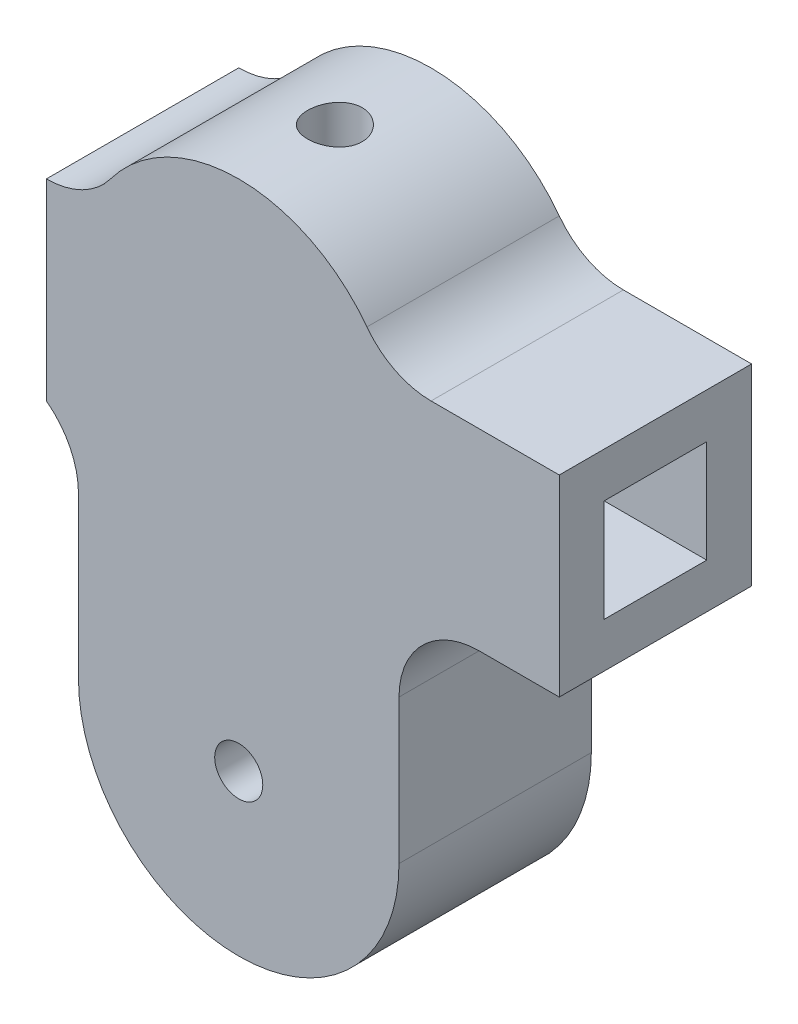
ISO-10303-21;
HEADER;
FILE_DESCRIPTION(('STEP AP214'),'2;1');
FILE_NAME('part.step','',(''),(''),'','','');
FILE_SCHEMA(('AUTOMOTIVE_DESIGN { 1 0 10303 214 1 1 1 1 }'));
ENDSEC;
DATA;
#1=APPLICATION_CONTEXT('core data for automotive mechanical design processes');
#2=APPLICATION_PROTOCOL_DEFINITION('international standard','automotive_design',2000,#1);
#3=PRODUCT_CONTEXT('',#1,'mechanical');
#4=PRODUCT('Part','Part','',(#3));
#5=PRODUCT_RELATED_PRODUCT_CATEGORY('part','',(#4));
#6=PRODUCT_DEFINITION_FORMATION('','',#4);
#7=PRODUCT_DEFINITION_CONTEXT('part definition',#1,'design');
#8=PRODUCT_DEFINITION('design','',#6,#7);
#9=PRODUCT_DEFINITION_SHAPE('','',#8);
#10=(LENGTH_UNIT() NAMED_UNIT(*) SI_UNIT(.MILLI.,.METRE.));
#11=(NAMED_UNIT(*) PLANE_ANGLE_UNIT() SI_UNIT($,.RADIAN.));
#12=(NAMED_UNIT(*) SI_UNIT($,.STERADIAN.) SOLID_ANGLE_UNIT());
#13=UNCERTAINTY_MEASURE_WITH_UNIT(LENGTH_MEASURE(1.E-05),#10,'distance_accuracy_value','');
#14=(GEOMETRIC_REPRESENTATION_CONTEXT(3) GLOBAL_UNCERTAINTY_ASSIGNED_CONTEXT((#13)) GLOBAL_UNIT_ASSIGNED_CONTEXT((#10,
#11,#12)) REPRESENTATION_CONTEXT('',''));
#15=CARTESIAN_POINT('',(0.,0.,0.));
#16=DIRECTION('',(0.,0.,1.));
#17=DIRECTION('',(1.,0.,0.));
#18=AXIS2_PLACEMENT_3D('',#15,#16,#17);
#19=CARTESIAN_POINT('',(0.,22.,0.));
#20=DIRECTION('',(0.,0.,1.));
#21=DIRECTION('',(1.,0.,0.));
#22=AXIS2_PLACEMENT_3D('',#19,#20,#21);
#23=PLANE('',#22);
#24=DIRECTION('',(1.,0.,0.));
#25=VECTOR('',#24,1.);
#26=CARTESIAN_POINT('',(2.8,27.8,0.));
#27=LINE('',#26,#25);
#28=CARTESIAN_POINT('',(-2.8,27.8,0.));
#29=VERTEX_POINT('',#28);
#30=CARTESIAN_POINT('',(2.8,27.8,0.));
#31=VERTEX_POINT('',#30);
#32=EDGE_CURVE('E233',#29,#31,#27,.T.);
#33=ORIENTED_EDGE('',*,*,#32,.F.);
#34=DIRECTION('',(0.,1.,0.));
#35=VECTOR('',#34,1.);
#36=CARTESIAN_POINT('',(-2.8,27.8,0.));
#37=LINE('',#36,#35);
#38=CARTESIAN_POINT('',(-2.8,24.7,0.));
#39=VERTEX_POINT('',#38);
#40=EDGE_CURVE('E200',#39,#29,#37,.T.);
#41=ORIENTED_EDGE('',*,*,#40,.F.);
#42=DIRECTION('',(-1.,0.,0.));
#43=VECTOR('',#42,1.);
#44=CARTESIAN_POINT('',(2.8,24.7,0.));
#45=LINE('',#44,#43);
#46=CARTESIAN_POINT('',(2.8,24.7,0.));
#47=VERTEX_POINT('',#46);
#48=EDGE_CURVE('E217',#47,#39,#45,.T.);
#49=ORIENTED_EDGE('',*,*,#48,.F.);
#50=DIRECTION('',(0.,-1.,0.));
#51=VECTOR('',#50,1.);
#52=CARTESIAN_POINT('',(2.8,27.8,0.));
#53=LINE('',#52,#51);
#54=EDGE_CURVE('E220',#31,#47,#53,.T.);
#55=ORIENTED_EDGE('',*,*,#54,.F.);
#56=EDGE_LOOP('',(#33,#41,#49,#55));
#57=FACE_BOUND('',#56,.T.);
#58=CARTESIAN_POINT('',(0.,22.,0.));
#59=DIRECTION('',(0.,0.,1.));
#60=DIRECTION('',(1.,0.,0.));
#61=AXIS2_PLACEMENT_3D('',#58,#59,#60);
#62=CIRCLE('',#61,10.);
#63=CARTESIAN_POINT('',(8.,28.,0.));
#64=VERTEX_POINT('',#63);
#65=CARTESIAN_POINT('',(-8.,28.,0.));
#66=VERTEX_POINT('',#65);
#67=EDGE_CURVE('E340',#64,#66,#62,.T.);
#68=ORIENTED_EDGE('',*,*,#67,.F.);
#69=CARTESIAN_POINT('',(12.,31.,0.));
#70=DIRECTION('',(0.,0.,1.));
#71=DIRECTION('',(1.,0.,0.));
#72=AXIS2_PLACEMENT_3D('',#69,#70,#71);
#73=CIRCLE('',#72,5.);
#74=CARTESIAN_POINT('',(12.,26.,0.));
#75=VERTEX_POINT('',#74);
#76=EDGE_CURVE('E392',#64,#75,#73,.T.);
#77=ORIENTED_EDGE('',*,*,#76,.T.);
#78=DIRECTION('',(1.,0.,0.));
#79=VECTOR('',#78,1.);
#80=CARTESIAN_POINT('',(-12.,26.,0.));
#81=LINE('',#80,#79);
#82=CARTESIAN_POINT('',(20.,26.,0.));
#83=VERTEX_POINT('',#82);
#84=EDGE_CURVE('E329',#75,#83,#81,.T.);
#85=ORIENTED_EDGE('',*,*,#84,.T.);
#86=DIRECTION('',(0.,1.,0.));
#87=VECTOR('',#86,1.);
#88=CARTESIAN_POINT('',(20.,14.,0.));
#89=LINE('',#88,#87);
#90=CARTESIAN_POINT('',(20.,14.,0.));
#91=VERTEX_POINT('',#90);
#92=EDGE_CURVE('E307',#91,#83,#89,.T.);
#93=ORIENTED_EDGE('',*,*,#92,.F.);
#94=DIRECTION('',(1.,0.,0.));
#95=VECTOR('',#94,1.);
#96=CARTESIAN_POINT('',(-12.,14.,0.));
#97=LINE('',#96,#95);
#98=CARTESIAN_POINT('',(15.,14.,0.));
#99=VERTEX_POINT('',#98);
#100=EDGE_CURVE('E330',#99,#91,#97,.T.);
#101=ORIENTED_EDGE('',*,*,#100,.F.);
#102=CARTESIAN_POINT('',(15.,9.00000000000001,0.));
#103=DIRECTION('',(0.,0.,1.));
#104=DIRECTION('',(1.,0.,0.));
#105=AXIS2_PLACEMENT_3D('',#102,#103,#104);
#106=CIRCLE('',#105,5.);
#107=CARTESIAN_POINT('',(10.,9.00000000000001,0.));
#108=VERTEX_POINT('',#107);
#109=EDGE_CURVE('E390',#99,#108,#106,.T.);
#110=ORIENTED_EDGE('',*,*,#109,.T.);
#111=DIRECTION('',(0.,1.,0.));
#112=VECTOR('',#111,1.);
#113=CARTESIAN_POINT('',(10.,22.,0.));
#114=LINE('',#113,#112);
#115=CARTESIAN_POINT('',(10.,0.,0.));
#116=VERTEX_POINT('',#115);
#117=EDGE_CURVE('E345',#116,#108,#114,.T.);
#118=ORIENTED_EDGE('',*,*,#117,.F.);
#119=CARTESIAN_POINT('',(0.,0.,0.));
#120=DIRECTION('',(0.,0.,1.));
#121=DIRECTION('',(1.,0.,0.));
#122=AXIS2_PLACEMENT_3D('',#119,#120,#121);
#123=CIRCLE('',#122,10.);
#124=CARTESIAN_POINT('',(-10.,0.,0.));
#125=VERTEX_POINT('',#124);
#126=EDGE_CURVE('E357',#125,#116,#123,.T.);
#127=ORIENTED_EDGE('',*,*,#126,.F.);
#128=DIRECTION('',(0.,-1.,0.));
#129=VECTOR('',#128,1.);
#130=CARTESIAN_POINT('',(-10.,22.,0.));
#131=LINE('',#130,#129);
#132=CARTESIAN_POINT('',(-10.,10.,0.));
#133=VERTEX_POINT('',#132);
#134=EDGE_CURVE('E355',#133,#125,#131,.T.);
#135=ORIENTED_EDGE('',*,*,#134,.F.);
#136=CARTESIAN_POINT('',(-15.,10.,0.));
#137=DIRECTION('',(0.,0.,1.));
#138=DIRECTION('',(1.,0.,0.));
#139=AXIS2_PLACEMENT_3D('',#136,#137,#138);
#140=CIRCLE('',#139,5.);
#141=CARTESIAN_POINT('',(-12.,14.,0.));
#142=VERTEX_POINT('',#141);
#143=EDGE_CURVE('E47',#133,#142,#140,.T.);
#144=ORIENTED_EDGE('',*,*,#143,.T.);
#145=DIRECTION('',(0.,1.,0.));
#146=VECTOR('',#145,1.);
#147=CARTESIAN_POINT('',(-12.,14.,0.));
#148=LINE('',#147,#146);
#149=CARTESIAN_POINT('',(-12.,26.,0.));
#150=VERTEX_POINT('',#149);
#151=EDGE_CURVE('E319',#142,#150,#148,.T.);
#152=ORIENTED_EDGE('',*,*,#151,.T.);
#153=CARTESIAN_POINT('',(-12.,31.,0.));
#154=DIRECTION('',(0.,0.,1.));
#155=DIRECTION('',(1.,0.,0.));
#156=AXIS2_PLACEMENT_3D('',#153,#154,#155);
#157=CIRCLE('',#156,5.);
#158=EDGE_CURVE('E11',#150,#66,#157,.T.);
#159=ORIENTED_EDGE('',*,*,#158,.T.);
#160=EDGE_LOOP('',(#68,#77,#85,#93,#101,#110,#118,#127,#135,#144,#152,#159));
#161=FACE_BOUND('',#160,.T.);
#162=CARTESIAN_POINT('',(0.,19.5,0.));
#163=DIRECTION('',(0.,0.,1.));
#164=DIRECTION('',(-1.,0.,0.));
#165=AXIS2_PLACEMENT_3D('',#162,#163,#164);
#166=CIRCLE('',#165,2.51143364997377);
#167=CARTESIAN_POINT('',(2.5,19.7393720497898,0.));
#168=VERTEX_POINT('',#167);
#169=CARTESIAN_POINT('',(-2.5,19.7393720497898,0.));
#170=VERTEX_POINT('',#169);
#171=EDGE_CURVE('E268',#168,#170,#166,.T.);
#172=ORIENTED_EDGE('',*,*,#171,.T.);
#173=DIRECTION('',(-0.0953129101349383,-0.995447361321335,0.));
#174=VECTOR('',#173,1.);
#175=CARTESIAN_POINT('',(-2.5,19.7393720497898,0.));
#176=LINE('',#175,#174);
#177=CARTESIAN_POINT('',(-4.37,0.209105236663276,0.));
#178=VERTEX_POINT('',#177);
#179=EDGE_CURVE('E288',#170,#178,#176,.T.);
#180=ORIENTED_EDGE('',*,*,#179,.T.);
#181=CARTESIAN_POINT('',(0.,0.,0.));
#182=DIRECTION('',(0.,0.,1.));
#183=DIRECTION('',(1.,0.,0.));
#184=AXIS2_PLACEMENT_3D('',#181,#182,#183);
#185=CIRCLE('',#184,4.375);
#186=CARTESIAN_POINT('',(4.37,0.209105236663275,0.));
#187=VERTEX_POINT('',#186);
#188=EDGE_CURVE('E291',#178,#187,#185,.T.);
#189=ORIENTED_EDGE('',*,*,#188,.T.);
#190=DIRECTION('',(-0.0953129101349383,0.995447361321335,0.));
#191=VECTOR('',#190,1.);
#192=CARTESIAN_POINT('',(2.5,19.7393720497898,0.));
#193=LINE('',#192,#191);
#194=EDGE_CURVE('E279',#187,#168,#193,.T.);
#195=ORIENTED_EDGE('',*,*,#194,.T.);
#196=EDGE_LOOP('',(#172,#180,#189,#195));
#197=FACE_BOUND('',#196,.T.);
#198=ADVANCED_FACE('F32',(#57,#161,#197),#23,.F.);
#199=CARTESIAN_POINT('',(0.,0.,12.));
#200=DIRECTION('',(0.,0.,-1.));
#201=DIRECTION('',(-1.,0.,0.));
#202=AXIS2_PLACEMENT_3D('',#199,#200,#201);
#203=CYLINDRICAL_SURFACE('',#202,1.5);
#204=CARTESIAN_POINT('',(0.,0.,12.));
#205=DIRECTION('',(0.,0.,1.));
#206=DIRECTION('',(1.,0.,0.));
#207=AXIS2_PLACEMENT_3D('',#204,#205,#206);
#208=CIRCLE('',#207,1.5);
#209=CARTESIAN_POINT('',(1.5,0.,12.));
#210=VERTEX_POINT('',#209);
#211=EDGE_CURVE('E332',#210,#210,#208,.T.);
#212=ORIENTED_EDGE('',*,*,#211,.T.);
#213=EDGE_LOOP('',(#212));
#214=FACE_BOUND('',#213,.T.);
#215=CARTESIAN_POINT('',(0.,0.,2.));
#216=DIRECTION('',(0.,0.,-1.));
#217=DIRECTION('',(-1.,0.,0.));
#218=AXIS2_PLACEMENT_3D('',#215,#216,#217);
#219=CIRCLE('',#218,1.5);
#220=CARTESIAN_POINT('',(-1.5,0.,2.));
#221=VERTEX_POINT('',#220);
#222=EDGE_CURVE('E306',#221,#221,#219,.T.);
#223=ORIENTED_EDGE('',*,*,#222,.T.);
#224=EDGE_LOOP('',(#223));
#225=FACE_BOUND('',#224,.T.);
#226=ADVANCED_FACE('F457',(#214,#225),#203,.F.);
#227=CARTESIAN_POINT('',(0.,22.,12.));
#228=DIRECTION('',(0.,0.,1.));
#229=DIRECTION('',(1.,0.,0.));
#230=AXIS2_PLACEMENT_3D('',#227,#228,#229);
#231=PLANE('',#230);
#232=DIRECTION('',(1.,0.,0.));
#233=VECTOR('',#232,1.);
#234=CARTESIAN_POINT('',(-12.,26.,12.));
#235=LINE('',#234,#233);
#236=CARTESIAN_POINT('',(12.,26.,12.));
#237=VERTEX_POINT('',#236);
#238=CARTESIAN_POINT('',(20.,26.,12.));
#239=VERTEX_POINT('',#238);
#240=EDGE_CURVE('E335',#237,#239,#235,.T.);
#241=ORIENTED_EDGE('',*,*,#240,.F.);
#242=CARTESIAN_POINT('',(12.,31.,12.));
#243=DIRECTION('',(0.,0.,1.));
#244=DIRECTION('',(1.,0.,0.));
#245=AXIS2_PLACEMENT_3D('',#242,#243,#244);
#246=CIRCLE('',#245,5.);
#247=CARTESIAN_POINT('',(8.,28.,12.));
#248=VERTEX_POINT('',#247);
#249=EDGE_CURVE('E394',#237,#248,#246,.F.);
#250=ORIENTED_EDGE('',*,*,#249,.T.);
#251=CARTESIAN_POINT('',(0.,22.,12.));
#252=DIRECTION('',(0.,0.,1.));
#253=DIRECTION('',(1.,0.,0.));
#254=AXIS2_PLACEMENT_3D('',#251,#252,#253);
#255=CIRCLE('',#254,10.);
#256=CARTESIAN_POINT('',(-8.,28.,12.));
#257=VERTEX_POINT('',#256);
#258=EDGE_CURVE('E341',#248,#257,#255,.T.);
#259=ORIENTED_EDGE('',*,*,#258,.T.);
#260=CARTESIAN_POINT('',(-12.,31.,12.));
#261=DIRECTION('',(0.,0.,1.));
#262=DIRECTION('',(1.,0.,0.));
#263=AXIS2_PLACEMENT_3D('',#260,#261,#262);
#264=CIRCLE('',#263,5.);
#265=CARTESIAN_POINT('',(-12.,26.,12.));
#266=VERTEX_POINT('',#265);
#267=EDGE_CURVE('E40',#257,#266,#264,.F.);
#268=ORIENTED_EDGE('',*,*,#267,.T.);
#269=DIRECTION('',(0.,-1.,0.));
#270=VECTOR('',#269,1.);
#271=CARTESIAN_POINT('',(-12.,14.,12.));
#272=LINE('',#271,#270);
#273=CARTESIAN_POINT('',(-12.,14.,12.));
#274=VERTEX_POINT('',#273);
#275=EDGE_CURVE('E325',#266,#274,#272,.T.);
#276=ORIENTED_EDGE('',*,*,#275,.T.);
#277=CARTESIAN_POINT('',(-15.,10.,12.));
#278=DIRECTION('',(0.,0.,1.));
#279=DIRECTION('',(1.,0.,0.));
#280=AXIS2_PLACEMENT_3D('',#277,#278,#279);
#281=CIRCLE('',#280,5.);
#282=CARTESIAN_POINT('',(-10.,10.,12.));
#283=VERTEX_POINT('',#282);
#284=EDGE_CURVE('E55',#274,#283,#281,.F.);
#285=ORIENTED_EDGE('',*,*,#284,.T.);
#286=DIRECTION('',(0.,-1.,0.));
#287=VECTOR('',#286,1.);
#288=CARTESIAN_POINT('',(-10.,22.,12.));
#289=LINE('',#288,#287);
#290=CARTESIAN_POINT('',(-10.,0.,12.));
#291=VERTEX_POINT('',#290);
#292=EDGE_CURVE('E344',#283,#291,#289,.T.);
#293=ORIENTED_EDGE('',*,*,#292,.T.);
#294=CARTESIAN_POINT('',(0.,0.,12.));
#295=DIRECTION('',(0.,0.,1.));
#296=DIRECTION('',(1.,0.,0.));
#297=AXIS2_PLACEMENT_3D('',#294,#295,#296);
#298=CIRCLE('',#297,10.);
#299=CARTESIAN_POINT('',(10.,0.,12.));
#300=VERTEX_POINT('',#299);
#301=EDGE_CURVE('E347',#291,#300,#298,.T.);
#302=ORIENTED_EDGE('',*,*,#301,.T.);
#303=DIRECTION('',(0.,1.,0.));
#304=VECTOR('',#303,1.);
#305=CARTESIAN_POINT('',(10.,22.,12.));
#306=LINE('',#305,#304);
#307=CARTESIAN_POINT('',(10.,9.00000000000001,12.));
#308=VERTEX_POINT('',#307);
#309=EDGE_CURVE('E349',#300,#308,#306,.T.);
#310=ORIENTED_EDGE('',*,*,#309,.T.);
#311=CARTESIAN_POINT('',(15.,9.00000000000001,12.));
#312=DIRECTION('',(0.,0.,1.));
#313=DIRECTION('',(1.,0.,0.));
#314=AXIS2_PLACEMENT_3D('',#311,#312,#313);
#315=CIRCLE('',#314,5.);
#316=CARTESIAN_POINT('',(15.,14.,12.));
#317=VERTEX_POINT('',#316);
#318=EDGE_CURVE('E388',#308,#317,#315,.F.);
#319=ORIENTED_EDGE('',*,*,#318,.T.);
#320=DIRECTION('',(1.,0.,0.));
#321=VECTOR('',#320,1.);
#322=CARTESIAN_POINT('',(-12.,14.,12.));
#323=LINE('',#322,#321);
#324=CARTESIAN_POINT('',(20.,14.,12.));
#325=VERTEX_POINT('',#324);
#326=EDGE_CURVE('E333',#317,#325,#323,.T.);
#327=ORIENTED_EDGE('',*,*,#326,.T.);
#328=DIRECTION('',(0.,-1.,0.));
#329=VECTOR('',#328,1.);
#330=CARTESIAN_POINT('',(20.,14.,12.));
#331=LINE('',#330,#329);
#332=EDGE_CURVE('E313',#239,#325,#331,.T.);
#333=ORIENTED_EDGE('',*,*,#332,.F.);
#334=EDGE_LOOP('',(#241,#250,#259,#268,#276,#285,#293,#302,#310,#319,#327,#333));
#335=FACE_BOUND('',#334,.T.);
#336=ORIENTED_EDGE('',*,*,#211,.F.);
#337=EDGE_LOOP('',(#336));
#338=FACE_BOUND('',#337,.T.);
#339=ADVANCED_FACE('F399',(#335,#338),#231,.T.);
#340=CARTESIAN_POINT('',(0.,22.,12.));
#341=DIRECTION('',(0.,0.,-1.));
#342=DIRECTION('',(-1.,0.,0.));
#343=AXIS2_PLACEMENT_3D('',#340,#341,#342);
#344=CYLINDRICAL_SURFACE('',#343,10.);
#345=CARTESIAN_POINT('',(0.,32.,4.3));
#346=CARTESIAN_POINT('',(0.0947576878946055,31.9999983585048,4.30000377426823));
#347=CARTESIAN_POINT('',(0.189566391791717,31.9986391365326,4.3079494293732));
#348=CARTESIAN_POINT('',(0.376522793597835,31.9933478351262,4.33950779581302));
#349=CARTESIAN_POINT('',(0.468667995816794,31.9894134194511,4.36313473363319));
#350=CARTESIAN_POINT('',(0.647565634171713,31.9794128476206,4.4253200785672));
#351=CARTESIAN_POINT('',(0.734322482783481,31.9733484635034,4.46386607640266));
#352=CARTESIAN_POINT('',(0.900126684803733,31.9597540525794,4.55476244084402));
#353=CARTESIAN_POINT('',(0.979174878995802,31.9522241858819,4.60711129965871));
#354=CARTESIAN_POINT('',(1.12811339489271,31.9364493929196,4.72468015800242));
#355=CARTESIAN_POINT('',(1.19791607072673,31.9281987056996,4.79001042782126));
#356=CARTESIAN_POINT('',(1.32562484199451,31.9119560635955,4.93145028967449));
#357=CARTESIAN_POINT('',(1.38353017137327,31.9039641253999,5.00756057528767));
#358=CARTESIAN_POINT('',(1.48615381918915,31.8890880402409,5.16900471159843));
#359=CARTESIAN_POINT('',(1.53078508643947,31.8822113350374,5.25439464291668));
#360=CARTESIAN_POINT('',(1.60503692511557,31.8704244466423,5.43159610594252));
#361=CARTESIAN_POINT('',(1.63465855265173,31.865514125097,5.52340718532692));
#362=CARTESIAN_POINT('',(1.67777332304485,31.8582734173444,5.70991431831559));
#363=CARTESIAN_POINT('',(1.69141802151836,31.8559188038212,5.80457437839511));
#364=CARTESIAN_POINT('',(1.70266159018217,31.853982860445,5.99486742648253));
#365=CARTESIAN_POINT('',(1.70026164178552,31.8544013264024,6.09050034233855));
#366=CARTESIAN_POINT('',(1.67960740432418,31.8579421500527,6.27894011262448));
#367=CARTESIAN_POINT('',(1.66152368158915,31.8610354173116,6.37176628860041));
#368=CARTESIAN_POINT('',(1.6102830462488,31.8695317501703,6.55304760389098));
#369=CARTESIAN_POINT('',(1.57712559765967,31.8749348979032,6.64150258765301));
#370=CARTESIAN_POINT('',(1.49650673760764,31.8874734630216,6.81203946337626));
#371=CARTESIAN_POINT('',(1.44897479731416,31.8946173872126,6.89408736266163));
#372=CARTESIAN_POINT('',(1.34100625557331,31.9098267031599,7.04910735861385));
#373=CARTESIAN_POINT('',(1.2805685715006,31.9178921721954,7.12207869306085));
#374=CARTESIAN_POINT('',(1.14757629513502,31.93416346381,7.25786121532253));
#375=CARTESIAN_POINT('',(1.07487542689003,31.9423697546128,7.32052916525897));
#376=CARTESIAN_POINT('',(0.91991440278867,31.9579019404777,7.43279855504831));
#377=CARTESIAN_POINT('',(0.837654180639252,31.9652278294336,7.48239990427799));
#378=CARTESIAN_POINT('',(0.665772592595596,31.9781848155279,7.56714234710082));
#379=CARTESIAN_POINT('',(0.576144697761933,31.9838143883947,7.60227044570547));
#380=CARTESIAN_POINT('',(0.392144072691743,31.9927322816352,7.65693449681323));
#381=CARTESIAN_POINT('',(0.297771756388138,31.9960208058782,7.6764718070531));
#382=CARTESIAN_POINT('',(0.108195402995363,31.9998585706286,7.6992047217622));
#383=CARTESIAN_POINT('',(0.0130155823423584,32.0004407604978,7.70259690383689));
#384=CARTESIAN_POINT('',(-0.176552208617397,31.9988906226238,7.6934678440613));
#385=CARTESIAN_POINT('',(-0.270940210514253,31.9967584036971,7.68094724013006));
#386=CARTESIAN_POINT('',(-0.45563535434648,31.9900394441558,7.64051151929459));
#387=CARTESIAN_POINT('',(-0.545964490519938,31.9854682783365,7.61269405198898));
#388=CARTESIAN_POINT('',(-0.720677070626036,31.9743819004117,7.54255857747464));
#389=CARTESIAN_POINT('',(-0.805060169222212,31.9678665755074,7.50023972888408));
#390=CARTESIAN_POINT('',(-0.966336947941809,31.9535327968044,7.40185485915965));
#391=CARTESIAN_POINT('',(-1.04315493575005,31.9457029518344,7.34566645175324));
#392=CARTESIAN_POINT('',(-1.18634178293015,31.9296421869603,7.22130537933282));
#393=CARTESIAN_POINT('',(-1.25270984995668,31.921411236705,7.15313180639519));
#394=CARTESIAN_POINT('',(-1.37384438851324,31.9053689727941,7.00585264391881));
#395=CARTESIAN_POINT('',(-1.42847783237172,31.8975631507801,6.92663694815387));
#396=CARTESIAN_POINT('',(-1.52366227424996,31.8833586881887,6.76003693583853));
#397=CARTESIAN_POINT('',(-1.56421373154811,31.8769600017207,6.67265288581376));
#398=CARTESIAN_POINT('',(-1.62988570006916,31.8663357914161,6.49256340175485));
#399=CARTESIAN_POINT('',(-1.65507162400974,31.8621010680533,6.39988238869255));
#400=CARTESIAN_POINT('',(-1.68950285881336,31.8562614793788,6.21152707245407));
#401=CARTESIAN_POINT('',(-1.69874961719307,31.8546563752585,6.11585304189256));
#402=CARTESIAN_POINT('',(-1.70099842807247,31.8542683356576,5.92555649227637));
#403=CARTESIAN_POINT('',(-1.69420993359399,31.8554490119915,5.83093645764805));
#404=CARTESIAN_POINT('',(-1.66503470775952,31.860419608446,5.64420600021117));
#405=CARTESIAN_POINT('',(-1.64264803293704,31.8642095191099,5.55209556830815));
#406=CARTESIAN_POINT('',(-1.5829934295977,31.8739574974925,5.37308483455114));
#407=CARTESIAN_POINT('',(-1.54574424734568,31.8799128330977,5.28617812738393));
#408=CARTESIAN_POINT('',(-1.45744370457911,31.893323172577,5.11981367766731));
#409=CARTESIAN_POINT('',(-1.40639161431834,31.9007782557359,5.0403563292574));
#410=CARTESIAN_POINT('',(-1.29118985102456,31.9164630889685,4.89008922946276));
#411=CARTESIAN_POINT('',(-1.22688632923809,31.9247012631332,4.81939828755894));
#412=CARTESIAN_POINT('',(-1.08733098491411,31.940957503145,4.68973876498284));
#413=CARTESIAN_POINT('',(-1.01207664192477,31.9489755178134,4.63077289037744));
#414=CARTESIAN_POINT('',(-0.852109586538185,31.9639552045839,4.52584704213854));
#415=CARTESIAN_POINT('',(-0.767332551982331,31.9709088381394,4.47998397145125));
#416=CARTESIAN_POINT('',(-0.5911925911508,31.9828980542761,4.40322128664598));
#417=CARTESIAN_POINT('',(-0.499836270638975,31.9879355296572,4.37230689784042));
#418=CARTESIAN_POINT('',(-0.34011457314761,31.9944364700191,4.33296367751762));
#419=CARTESIAN_POINT('',(-0.272710808068804,31.9965115472255,4.32062229455269));
#420=CARTESIAN_POINT('',(-0.136880224020147,31.9992938925805,4.30413916773769));
#421=CARTESIAN_POINT('',(-0.0684534238433405,32.0000011858243,4.29999727344991));
#422=CARTESIAN_POINT('',(0.,32.,4.3));
#423=B_SPLINE_CURVE_WITH_KNOTS('',3,(#345,#346,#347,#348,#349,#350,#351,#352,#353,#354,#355,
#356,#357,#358,#359,#360,#361,#362,#363,#364,#365,#366,#367,#368,#369,#370,#371,#372,#373,#374,
#375,#376,#377,#378,#379,#380,#381,#382,#383,#384,#385,#386,#387,#388,#389,#390,#391,#392,#393,
#394,#395,#396,#397,#398,#399,#400,#401,#402,#403,#404,#405,#406,#407,#408,#409,#410,#411,#412,
#413,#414,#415,#416,#417,#418,#419,#420,#421,#422),.UNSPECIFIED.,.T.,.F.,(4,2,2,2,2,2,2,2,2,2,2,
2,2,2,2,2,2,2,2,2,2,2,2,2,2,2,2,2,2,2,2,2,2,2,2,2,2,2,4),(0.,0.284022828438538,
0.568303682958859,0.852348586605788,1.13636247471906,1.42290084405775,1.70945765745934,
1.99785424638948,2.28623054029933,2.57184857573335,2.85744558052973,3.13997502422671,
3.42251451474645,3.70646342600059,3.99043616626788,4.27807283462104,4.56571149782112,
4.85360786111796,5.14147914998386,5.42583629106419,5.71018203306509,5.99273333952095,
6.27530104260756,6.56045734817344,6.84563526477151,7.13389286809599,7.42214106913036,
7.70915344460832,7.99613975365977,8.2793982075421,8.56265563479788,8.84555690967838,
9.12847314419732,9.41488053086676,9.70135394191367,9.98989417240834,10.2781486352408,
10.4833319001627,10.6885114005101),.UNSPECIFIED.);
#424=CARTESIAN_POINT('',(0.,32.,4.3));
#425=VERTEX_POINT('',#424);
#426=EDGE_CURVE('E223',#425,#425,#423,.T.);
#427=ORIENTED_EDGE('',*,*,#426,.T.);
#428=EDGE_LOOP('',(#427));
#429=FACE_BOUND('',#428,.T.);
#430=ORIENTED_EDGE('',*,*,#258,.F.);
#431=DIRECTION('',(0.,0.,-1.));
#432=VECTOR('',#431,1.);
#433=CARTESIAN_POINT('',(8.00000000000001,28.,12.));
#434=LINE('',#433,#432);
#435=EDGE_CURVE('E381',#248,#64,#434,.T.);
#436=ORIENTED_EDGE('',*,*,#435,.T.);
#437=ORIENTED_EDGE('',*,*,#67,.T.);
#438=DIRECTION('',(0.,0.,-1.));
#439=VECTOR('',#438,1.);
#440=CARTESIAN_POINT('',(-8.00000000000001,28.,12.));
#441=LINE('',#440,#439);
#442=EDGE_CURVE('E378',#66,#257,#441,.F.);
#443=ORIENTED_EDGE('',*,*,#442,.T.);
#444=EDGE_LOOP('',(#430,#436,#437,#443));
#445=FACE_BOUND('',#444,.T.);
#446=ADVANCED_FACE('F413',(#429,#445),#344,.T.);
#447=CARTESIAN_POINT('',(-10.,22.,12.));
#448=DIRECTION('',(1.,0.,0.));
#449=DIRECTION('',(0.,0.,-1.));
#450=AXIS2_PLACEMENT_3D('',#447,#448,#449);
#451=PLANE('',#450);
#452=ORIENTED_EDGE('',*,*,#292,.F.);
#453=DIRECTION('',(0.,0.,1.));
#454=VECTOR('',#453,1.);
#455=CARTESIAN_POINT('',(-10.,10.,12.));
#456=LINE('',#455,#454);
#457=EDGE_CURVE('E386',#283,#133,#456,.F.);
#458=ORIENTED_EDGE('',*,*,#457,.T.);
#459=ORIENTED_EDGE('',*,*,#134,.T.);
#460=DIRECTION('',(0.,0.,-1.));
#461=VECTOR('',#460,1.);
#462=CARTESIAN_POINT('',(-10.,0.,12.));
#463=LINE('',#462,#461);
#464=EDGE_CURVE('E363',#291,#125,#463,.T.);
#465=ORIENTED_EDGE('',*,*,#464,.F.);
#466=EDGE_LOOP('',(#452,#458,#459,#465));
#467=FACE_BOUND('',#466,.T.);
#468=ADVANCED_FACE('F448',(#467),#451,.F.);
#469=CARTESIAN_POINT('',(0.,0.,12.));
#470=DIRECTION('',(0.,0.,-1.));
#471=DIRECTION('',(-1.,0.,0.));
#472=AXIS2_PLACEMENT_3D('',#469,#470,#471);
#473=CYLINDRICAL_SURFACE('',#472,10.);
#474=ORIENTED_EDGE('',*,*,#126,.T.);
#475=DIRECTION('',(0.,0.,-1.));
#476=VECTOR('',#475,1.);
#477=CARTESIAN_POINT('',(10.,0.,12.));
#478=LINE('',#477,#476);
#479=EDGE_CURVE('E352',#300,#116,#478,.T.);
#480=ORIENTED_EDGE('',*,*,#479,.F.);
#481=ORIENTED_EDGE('',*,*,#301,.F.);
#482=ORIENTED_EDGE('',*,*,#464,.T.);
#483=EDGE_LOOP('',(#474,#480,#481,#482));
#484=FACE_BOUND('',#483,.T.);
#485=ADVANCED_FACE('F444',(#484),#473,.T.);
#486=CARTESIAN_POINT('',(10.,22.,12.));
#487=DIRECTION('',(-1.,0.,0.));
#488=DIRECTION('',(0.,-1.,0.));
#489=AXIS2_PLACEMENT_3D('',#486,#487,#488);
#490=PLANE('',#489);
#491=ORIENTED_EDGE('',*,*,#117,.T.);
#492=DIRECTION('',(0.,0.,1.));
#493=VECTOR('',#492,1.);
#494=CARTESIAN_POINT('',(10.,9.00000000000001,12.));
#495=LINE('',#494,#493);
#496=EDGE_CURVE('E366',#108,#308,#495,.T.);
#497=ORIENTED_EDGE('',*,*,#496,.T.);
#498=ORIENTED_EDGE('',*,*,#309,.F.);
#499=ORIENTED_EDGE('',*,*,#479,.T.);
#500=EDGE_LOOP('',(#491,#497,#498,#499));
#501=FACE_BOUND('',#500,.T.);
#502=ADVANCED_FACE('F438',(#501),#490,.F.);
#503=CARTESIAN_POINT('',(20.,0.,0.));
#504=DIRECTION('',(1.,0.,0.));
#505=DIRECTION('',(0.,0.,-1.));
#506=AXIS2_PLACEMENT_3D('',#503,#504,#505);
#507=PLANE('',#506);
#508=DIRECTION('',(0.,1.,0.));
#509=VECTOR('',#508,1.);
#510=CARTESIAN_POINT('',(20.,23.2,2.8));
#511=LINE('',#510,#509);
#512=CARTESIAN_POINT('',(20.,16.8,2.8));
#513=VERTEX_POINT('',#512);
#514=CARTESIAN_POINT('',(20.,23.2,2.8));
#515=VERTEX_POINT('',#514);
#516=EDGE_CURVE('E239',#513,#515,#511,.T.);
#517=ORIENTED_EDGE('',*,*,#516,.F.);
#518=DIRECTION('',(0.,0.,-1.));
#519=VECTOR('',#518,1.);
#520=CARTESIAN_POINT('',(20.,16.8,9.2));
#521=LINE('',#520,#519);
#522=CARTESIAN_POINT('',(20.,16.8,9.2));
#523=VERTEX_POINT('',#522);
#524=EDGE_CURVE('E247',#523,#513,#521,.T.);
#525=ORIENTED_EDGE('',*,*,#524,.F.);
#526=DIRECTION('',(0.,-1.,0.));
#527=VECTOR('',#526,1.);
#528=CARTESIAN_POINT('',(20.,23.2,9.2));
#529=LINE('',#528,#527);
#530=CARTESIAN_POINT('',(20.,23.2,9.2));
#531=VERTEX_POINT('',#530);
#532=EDGE_CURVE('E261',#531,#523,#529,.T.);
#533=ORIENTED_EDGE('',*,*,#532,.F.);
#534=DIRECTION('',(0.,0.,1.));
#535=VECTOR('',#534,1.);
#536=CARTESIAN_POINT('',(20.,23.2,9.2));
#537=LINE('',#536,#535);
#538=EDGE_CURVE('E258',#515,#531,#537,.T.);
#539=ORIENTED_EDGE('',*,*,#538,.F.);
#540=EDGE_LOOP('',(#517,#525,#533,#539));
#541=FACE_BOUND('',#540,.T.);
#542=ORIENTED_EDGE('',*,*,#92,.T.);
#543=DIRECTION('',(0.,0.,1.));
#544=VECTOR('',#543,1.);
#545=CARTESIAN_POINT('',(20.,26.,0.));
#546=LINE('',#545,#544);
#547=EDGE_CURVE('E310',#83,#239,#546,.T.);
#548=ORIENTED_EDGE('',*,*,#547,.T.);
#549=ORIENTED_EDGE('',*,*,#332,.T.);
#550=DIRECTION('',(0.,0.,-1.));
#551=VECTOR('',#550,1.);
#552=CARTESIAN_POINT('',(20.,14.,0.));
#553=LINE('',#552,#551);
#554=EDGE_CURVE('E316',#325,#91,#553,.T.);
#555=ORIENTED_EDGE('',*,*,#554,.T.);
#556=EDGE_LOOP('',(#542,#548,#549,#555));
#557=FACE_BOUND('',#556,.T.);
#558=ADVANCED_FACE('F426',(#541,#557),#507,.T.);
#559=CARTESIAN_POINT('',(-12.,14.,0.));
#560=DIRECTION('',(0.,-1.,0.));
#561=DIRECTION('',(0.,0.,-1.));
#562=AXIS2_PLACEMENT_3D('',#559,#560,#561);
#563=PLANE('',#562);
#564=ORIENTED_EDGE('',*,*,#326,.F.);
#565=DIRECTION('',(0.,0.,1.));
#566=VECTOR('',#565,1.);
#567=CARTESIAN_POINT('',(15.,14.,0.));
#568=LINE('',#567,#566);
#569=EDGE_CURVE('E376',#317,#99,#568,.F.);
#570=ORIENTED_EDGE('',*,*,#569,.T.);
#571=ORIENTED_EDGE('',*,*,#100,.T.);
#572=ORIENTED_EDGE('',*,*,#554,.F.);
#573=EDGE_LOOP('',(#564,#570,#571,#572));
#574=FACE_BOUND('',#573,.T.);
#575=ADVANCED_FACE('F544',(#574),#563,.T.);
#576=CARTESIAN_POINT('',(-12.,26.,0.));
#577=DIRECTION('',(0.,1.,0.));
#578=DIRECTION('',(0.,0.,1.));
#579=AXIS2_PLACEMENT_3D('',#576,#577,#578);
#580=PLANE('',#579);
#581=ORIENTED_EDGE('',*,*,#84,.F.);
#582=DIRECTION('',(0.,0.,-1.));
#583=VECTOR('',#582,1.);
#584=CARTESIAN_POINT('',(12.,26.,0.));
#585=LINE('',#584,#583);
#586=EDGE_CURVE('E384',#75,#237,#585,.F.);
#587=ORIENTED_EDGE('',*,*,#586,.T.);
#588=ORIENTED_EDGE('',*,*,#240,.T.);
#589=ORIENTED_EDGE('',*,*,#547,.F.);
#590=EDGE_LOOP('',(#581,#587,#588,#589));
#591=FACE_BOUND('',#590,.T.);
#592=ADVANCED_FACE('F423',(#591),#580,.T.);
#593=CARTESIAN_POINT('',(-12.,0.,0.));
#594=DIRECTION('',(1.,0.,0.));
#595=DIRECTION('',(0.,0.,-1.));
#596=AXIS2_PLACEMENT_3D('',#593,#594,#595);
#597=PLANE('',#596);
#598=DIRECTION('',(0.,0.,-1.));
#599=VECTOR('',#598,1.);
#600=CARTESIAN_POINT('',(-12.,16.8,9.2));
#601=LINE('',#600,#599);
#602=CARTESIAN_POINT('',(-12.,16.8,9.2));
#603=VERTEX_POINT('',#602);
#604=CARTESIAN_POINT('',(-12.,16.8,2.8));
#605=VERTEX_POINT('',#604);
#606=EDGE_CURVE('E253',#603,#605,#601,.T.);
#607=ORIENTED_EDGE('',*,*,#606,.T.);
#608=DIRECTION('',(0.,1.,0.));
#609=VECTOR('',#608,1.);
#610=CARTESIAN_POINT('',(-12.,23.2,2.8));
#611=LINE('',#610,#609);
#612=CARTESIAN_POINT('',(-12.,23.2,2.8));
#613=VERTEX_POINT('',#612);
#614=EDGE_CURVE('E243',#605,#613,#611,.T.);
#615=ORIENTED_EDGE('',*,*,#614,.T.);
#616=DIRECTION('',(0.,0.,1.));
#617=VECTOR('',#616,1.);
#618=CARTESIAN_POINT('',(-12.,23.2,9.2));
#619=LINE('',#618,#617);
#620=CARTESIAN_POINT('',(-12.,23.2,9.2));
#621=VERTEX_POINT('',#620);
#622=EDGE_CURVE('E246',#613,#621,#619,.T.);
#623=ORIENTED_EDGE('',*,*,#622,.T.);
#624=DIRECTION('',(0.,-1.,0.));
#625=VECTOR('',#624,1.);
#626=CARTESIAN_POINT('',(-12.,23.2,9.2));
#627=LINE('',#626,#625);
#628=EDGE_CURVE('E250',#621,#603,#627,.T.);
#629=ORIENTED_EDGE('',*,*,#628,.T.);
#630=EDGE_LOOP('',(#607,#615,#623,#629));
#631=FACE_BOUND('',#630,.T.);
#632=ORIENTED_EDGE('',*,*,#151,.F.);
#633=DIRECTION('',(0.,0.,-1.));
#634=VECTOR('',#633,1.);
#635=CARTESIAN_POINT('',(-12.,14.,0.));
#636=LINE('',#635,#634);
#637=EDGE_CURVE('E327',#274,#142,#636,.T.);
#638=ORIENTED_EDGE('',*,*,#637,.F.);
#639=ORIENTED_EDGE('',*,*,#275,.F.);
#640=DIRECTION('',(0.,0.,1.));
#641=VECTOR('',#640,1.);
#642=CARTESIAN_POINT('',(-12.,26.,0.));
#643=LINE('',#642,#641);
#644=EDGE_CURVE('E322',#150,#266,#643,.T.);
#645=ORIENTED_EDGE('',*,*,#644,.F.);
#646=EDGE_LOOP('',(#632,#638,#639,#645));
#647=FACE_BOUND('',#646,.T.);
#648=ADVANCED_FACE('F407',(#631,#647),#597,.F.);
#649=CARTESIAN_POINT('',(0.,19.5,2.));
#650=DIRECTION('',(0.,0.,-1.));
#651=DIRECTION('',(-1.,0.,0.));
#652=AXIS2_PLACEMENT_3D('',#649,#650,#651);
#653=CYLINDRICAL_SURFACE('',#652,2.51143364997377);
#654=ORIENTED_EDGE('',*,*,#171,.F.);
#655=DIRECTION('',(0.,0.,-1.));
#656=VECTOR('',#655,1.);
#657=CARTESIAN_POINT('',(2.5,19.7393720497898,2.));
#658=LINE('',#657,#656);
#659=CARTESIAN_POINT('',(2.5,19.7393720497898,2.));
#660=VERTEX_POINT('',#659);
#661=EDGE_CURVE('E285',#660,#168,#658,.T.);
#662=ORIENTED_EDGE('',*,*,#661,.F.);
#663=CARTESIAN_POINT('',(0.,19.5,2.));
#664=DIRECTION('',(0.,0.,1.));
#665=DIRECTION('',(-1.,0.,0.));
#666=AXIS2_PLACEMENT_3D('',#663,#664,#665);
#667=CIRCLE('',#666,2.51143364997377);
#668=CARTESIAN_POINT('',(-2.5,19.7393720497898,2.));
#669=VERTEX_POINT('',#668);
#670=EDGE_CURVE('E275',#660,#669,#667,.T.);
#671=ORIENTED_EDGE('',*,*,#670,.T.);
#672=DIRECTION('',(0.,0.,-1.));
#673=VECTOR('',#672,1.);
#674=CARTESIAN_POINT('',(-2.5,19.7393720497898,2.));
#675=LINE('',#674,#673);
#676=EDGE_CURVE('E303',#669,#170,#675,.T.);
#677=ORIENTED_EDGE('',*,*,#676,.T.);
#678=EDGE_LOOP('',(#654,#662,#671,#677));
#679=FACE_BOUND('',#678,.T.);
#680=ADVANCED_FACE('F537',(#679),#653,.F.);
#681=CARTESIAN_POINT('',(-2.5,19.7393720497898,2.));
#682=DIRECTION('',(0.995447361321335,-0.0953129101349383,0.));
#683=DIRECTION('',(0.0953129101349383,0.995447361321335,0.));
#684=AXIS2_PLACEMENT_3D('',#681,#682,#683);
#685=PLANE('',#684);
#686=ORIENTED_EDGE('',*,*,#179,.F.);
#687=ORIENTED_EDGE('',*,*,#676,.F.);
#688=DIRECTION('',(-0.0953129101349383,-0.995447361321335,0.));
#689=VECTOR('',#688,1.);
#690=CARTESIAN_POINT('',(-2.5,19.7393720497898,2.));
#691=LINE('',#690,#689);
#692=CARTESIAN_POINT('',(-4.37,0.209105236663276,2.));
#693=VERTEX_POINT('',#692);
#694=EDGE_CURVE('E278',#669,#693,#691,.T.);
#695=ORIENTED_EDGE('',*,*,#694,.T.);
#696=DIRECTION('',(0.,0.,-1.));
#697=VECTOR('',#696,1.);
#698=CARTESIAN_POINT('',(-4.37,0.209105236663276,2.));
#699=LINE('',#698,#697);
#700=EDGE_CURVE('E300',#693,#178,#699,.T.);
#701=ORIENTED_EDGE('',*,*,#700,.T.);
#702=EDGE_LOOP('',(#686,#687,#695,#701));
#703=FACE_BOUND('',#702,.T.);
#704=ADVANCED_FACE('F533',(#703),#685,.T.);
#705=CARTESIAN_POINT('',(0.,0.,2.));
#706=DIRECTION('',(0.,0.,-1.));
#707=DIRECTION('',(-1.,0.,0.));
#708=AXIS2_PLACEMENT_3D('',#705,#706,#707);
#709=CYLINDRICAL_SURFACE('',#708,4.375);
#710=ORIENTED_EDGE('',*,*,#188,.F.);
#711=ORIENTED_EDGE('',*,*,#700,.F.);
#712=CARTESIAN_POINT('',(0.,0.,2.));
#713=DIRECTION('',(0.,0.,1.));
#714=DIRECTION('',(1.,0.,0.));
#715=AXIS2_PLACEMENT_3D('',#712,#713,#714);
#716=CIRCLE('',#715,4.375);
#717=CARTESIAN_POINT('',(4.37,0.209105236663275,2.));
#718=VERTEX_POINT('',#717);
#719=EDGE_CURVE('E281',#693,#718,#716,.T.);
#720=ORIENTED_EDGE('',*,*,#719,.T.);
#721=DIRECTION('',(0.,0.,-1.));
#722=VECTOR('',#721,1.);
#723=CARTESIAN_POINT('',(4.37,0.209105236663275,2.));
#724=LINE('',#723,#722);
#725=EDGE_CURVE('E298',#718,#187,#724,.T.);
#726=ORIENTED_EDGE('',*,*,#725,.T.);
#727=EDGE_LOOP('',(#710,#711,#720,#726));
#728=FACE_BOUND('',#727,.T.);
#729=ADVANCED_FACE('F529',(#728),#709,.F.);
#730=CARTESIAN_POINT('',(2.5,19.7393720497898,2.));
#731=DIRECTION('',(-0.995447361321335,-0.0953129101349383,0.));
#732=DIRECTION('',(0.0953129101349383,-0.995447361321335,0.));
#733=AXIS2_PLACEMENT_3D('',#730,#731,#732);
#734=PLANE('',#733);
#735=ORIENTED_EDGE('',*,*,#194,.F.);
#736=ORIENTED_EDGE('',*,*,#725,.F.);
#737=DIRECTION('',(-0.0953129101349383,0.995447361321335,0.));
#738=VECTOR('',#737,1.);
#739=CARTESIAN_POINT('',(2.5,19.7393720497898,2.));
#740=LINE('',#739,#738);
#741=EDGE_CURVE('E283',#718,#660,#740,.T.);
#742=ORIENTED_EDGE('',*,*,#741,.T.);
#743=ORIENTED_EDGE('',*,*,#661,.T.);
#744=EDGE_LOOP('',(#735,#736,#742,#743));
#745=FACE_BOUND('',#744,.T.);
#746=ADVANCED_FACE('F525',(#745),#734,.T.);
#747=CARTESIAN_POINT('',(0.,19.5,2.));
#748=DIRECTION('',(0.,0.,-1.));
#749=DIRECTION('',(-1.,0.,0.));
#750=AXIS2_PLACEMENT_3D('',#747,#748,#749);
#751=PLANE('',#750);
#752=ORIENTED_EDGE('',*,*,#222,.F.);
#753=EDGE_LOOP('',(#752));
#754=FACE_BOUND('',#753,.T.);
#755=ORIENTED_EDGE('',*,*,#670,.F.);
#756=ORIENTED_EDGE('',*,*,#741,.F.);
#757=ORIENTED_EDGE('',*,*,#719,.F.);
#758=ORIENTED_EDGE('',*,*,#694,.F.);
#759=EDGE_LOOP('',(#755,#756,#757,#758));
#760=FACE_BOUND('',#759,.T.);
#761=ADVANCED_FACE('F521',(#754,#760),#751,.T.);
#762=CARTESIAN_POINT('',(-12.,23.2,2.8));
#763=DIRECTION('',(0.,0.,-1.));
#764=DIRECTION('',(-1.,0.,0.));
#765=AXIS2_PLACEMENT_3D('',#762,#763,#764);
#766=PLANE('',#765);
#767=ORIENTED_EDGE('',*,*,#516,.T.);
#768=DIRECTION('',(1.,0.,0.));
#769=VECTOR('',#768,1.);
#770=CARTESIAN_POINT('',(-12.,23.2,2.8));
#771=LINE('',#770,#769);
#772=EDGE_CURVE('E256',#613,#515,#771,.T.);
#773=ORIENTED_EDGE('',*,*,#772,.F.);
#774=ORIENTED_EDGE('',*,*,#614,.F.);
#775=DIRECTION('',(1.,0.,0.));
#776=VECTOR('',#775,1.);
#777=CARTESIAN_POINT('',(-12.,16.8,2.8));
#778=LINE('',#777,#776);
#779=EDGE_CURVE('E266',#605,#513,#778,.T.);
#780=ORIENTED_EDGE('',*,*,#779,.T.);
#781=EDGE_LOOP('',(#767,#773,#774,#780));
#782=FACE_BOUND('',#781,.T.);
#783=ADVANCED_FACE('F511',(#782),#766,.F.);
#784=CARTESIAN_POINT('',(-12.,16.8,9.2));
#785=DIRECTION('',(0.,-1.,0.));
#786=DIRECTION('',(0.,0.,-1.));
#787=AXIS2_PLACEMENT_3D('',#784,#785,#786);
#788=PLANE('',#787);
#789=ORIENTED_EDGE('',*,*,#524,.T.);
#790=ORIENTED_EDGE('',*,*,#779,.F.);
#791=ORIENTED_EDGE('',*,*,#606,.F.);
#792=DIRECTION('',(1.,0.,0.));
#793=VECTOR('',#792,1.);
#794=CARTESIAN_POINT('',(-12.,16.8,9.2));
#795=LINE('',#794,#793);
#796=EDGE_CURVE('E269',#603,#523,#795,.T.);
#797=ORIENTED_EDGE('',*,*,#796,.T.);
#798=EDGE_LOOP('',(#789,#790,#791,#797));
#799=FACE_BOUND('',#798,.T.);
#800=ADVANCED_FACE('F507',(#799),#788,.F.);
#801=CARTESIAN_POINT('',(-12.,23.2,9.2));
#802=DIRECTION('',(0.,0.,1.));
#803=DIRECTION('',(1.,0.,0.));
#804=AXIS2_PLACEMENT_3D('',#801,#802,#803);
#805=PLANE('',#804);
#806=ORIENTED_EDGE('',*,*,#532,.T.);
#807=ORIENTED_EDGE('',*,*,#796,.F.);
#808=ORIENTED_EDGE('',*,*,#628,.F.);
#809=DIRECTION('',(1.,0.,0.));
#810=VECTOR('',#809,1.);
#811=CARTESIAN_POINT('',(-12.,23.2,9.2));
#812=LINE('',#811,#810);
#813=EDGE_CURVE('E271',#621,#531,#812,.T.);
#814=ORIENTED_EDGE('',*,*,#813,.T.);
#815=EDGE_LOOP('',(#806,#807,#808,#814));
#816=FACE_BOUND('',#815,.T.);
#817=ADVANCED_FACE('F510',(#816),#805,.F.);
#818=CARTESIAN_POINT('',(-12.,23.2,9.2));
#819=DIRECTION('',(0.,1.,0.));
#820=DIRECTION('',(0.,0.,1.));
#821=AXIS2_PLACEMENT_3D('',#818,#819,#820);
#822=PLANE('',#821);
#823=CARTESIAN_POINT('',(0.,23.2,6.));
#824=DIRECTION('',(0.,-1.,0.));
#825=DIRECTION('',(0.,0.,-1.));
#826=AXIS2_PLACEMENT_3D('',#823,#824,#825);
#827=CIRCLE('',#826,1.7);
#828=CARTESIAN_POINT('',(0.,23.2,4.3));
#829=VERTEX_POINT('',#828);
#830=EDGE_CURVE('E373',#829,#829,#827,.T.);
#831=ORIENTED_EDGE('',*,*,#830,.F.);
#832=EDGE_LOOP('',(#831));
#833=FACE_BOUND('',#832,.T.);
#834=ORIENTED_EDGE('',*,*,#538,.T.);
#835=ORIENTED_EDGE('',*,*,#813,.F.);
#836=ORIENTED_EDGE('',*,*,#622,.F.);
#837=ORIENTED_EDGE('',*,*,#772,.T.);
#838=EDGE_LOOP('',(#834,#835,#836,#837));
#839=FACE_BOUND('',#838,.T.);
#840=ADVANCED_FACE('F506',(#833,#839),#822,.F.);
#841=CARTESIAN_POINT('',(-2.8,27.8,9.));
#842=DIRECTION('',(-1.,0.,0.));
#843=DIRECTION('',(0.,-1.,0.));
#844=AXIS2_PLACEMENT_3D('',#841,#842,#843);
#845=PLANE('',#844);
#846=ORIENTED_EDGE('',*,*,#40,.T.);
#847=DIRECTION('',(0.,0.,-1.));
#848=VECTOR('',#847,1.);
#849=CARTESIAN_POINT('',(-2.8,27.8,9.));
#850=LINE('',#849,#848);
#851=CARTESIAN_POINT('',(-2.8,27.8,9.));
#852=VERTEX_POINT('',#851);
#853=EDGE_CURVE('E193',#852,#29,#850,.T.);
#854=ORIENTED_EDGE('',*,*,#853,.F.);
#855=DIRECTION('',(0.,1.,0.));
#856=VECTOR('',#855,1.);
#857=CARTESIAN_POINT('',(-2.8,27.8,9.));
#858=LINE('',#857,#856);
#859=CARTESIAN_POINT('',(-2.8,24.7,9.));
#860=VERTEX_POINT('',#859);
#861=EDGE_CURVE('E197',#860,#852,#858,.T.);
#862=ORIENTED_EDGE('',*,*,#861,.F.);
#863=DIRECTION('',(0.,0.,-1.));
#864=VECTOR('',#863,1.);
#865=CARTESIAN_POINT('',(-2.8,24.7,9.));
#866=LINE('',#865,#864);
#867=EDGE_CURVE('E237',#860,#39,#866,.T.);
#868=ORIENTED_EDGE('',*,*,#867,.T.);
#869=EDGE_LOOP('',(#846,#854,#862,#868));
#870=FACE_BOUND('',#869,.T.);
#871=ADVANCED_FACE('F195',(#870),#845,.F.);
#872=CARTESIAN_POINT('',(2.8,24.7,9.));
#873=DIRECTION('',(0.,-1.,0.));
#874=DIRECTION('',(0.,0.,-1.));
#875=AXIS2_PLACEMENT_3D('',#872,#873,#874);
#876=PLANE('',#875);
#877=CARTESIAN_POINT('',(0.,24.7,6.));
#878=DIRECTION('',(0.,-1.,0.));
#879=DIRECTION('',(0.,0.,-1.));
#880=AXIS2_PLACEMENT_3D('',#877,#878,#879);
#881=CIRCLE('',#880,1.7);
#882=CARTESIAN_POINT('',(0.,24.7,4.3));
#883=VERTEX_POINT('',#882);
#884=EDGE_CURVE('E372',#883,#883,#881,.T.);
#885=ORIENTED_EDGE('',*,*,#884,.T.);
#886=EDGE_LOOP('',(#885));
#887=FACE_BOUND('',#886,.T.);
#888=ORIENTED_EDGE('',*,*,#48,.T.);
#889=ORIENTED_EDGE('',*,*,#867,.F.);
#890=DIRECTION('',(-1.,0.,0.));
#891=VECTOR('',#890,1.);
#892=CARTESIAN_POINT('',(2.8,24.7,9.));
#893=LINE('',#892,#891);
#894=CARTESIAN_POINT('',(2.8,24.7,9.));
#895=VERTEX_POINT('',#894);
#896=EDGE_CURVE('E205',#895,#860,#893,.T.);
#897=ORIENTED_EDGE('',*,*,#896,.F.);
#898=DIRECTION('',(0.,0.,-1.));
#899=VECTOR('',#898,1.);
#900=CARTESIAN_POINT('',(2.8,24.7,9.));
#901=LINE('',#900,#899);
#902=EDGE_CURVE('E240',#895,#47,#901,.T.);
#903=ORIENTED_EDGE('',*,*,#902,.T.);
#904=EDGE_LOOP('',(#888,#889,#897,#903));
#905=FACE_BOUND('',#904,.T.);
#906=ADVANCED_FACE('F493',(#887,#905),#876,.F.);
#907=CARTESIAN_POINT('',(2.8,27.8,9.));
#908=DIRECTION('',(1.,0.,0.));
#909=DIRECTION('',(0.,1.,0.));
#910=AXIS2_PLACEMENT_3D('',#907,#908,#909);
#911=PLANE('',#910);
#912=ORIENTED_EDGE('',*,*,#54,.T.);
#913=ORIENTED_EDGE('',*,*,#902,.F.);
#914=DIRECTION('',(0.,-1.,0.));
#915=VECTOR('',#914,1.);
#916=CARTESIAN_POINT('',(2.8,27.8,9.));
#917=LINE('',#916,#915);
#918=CARTESIAN_POINT('',(2.8,27.8,9.));
#919=VERTEX_POINT('',#918);
#920=EDGE_CURVE('E213',#919,#895,#917,.T.);
#921=ORIENTED_EDGE('',*,*,#920,.F.);
#922=DIRECTION('',(0.,0.,-1.));
#923=VECTOR('',#922,1.);
#924=CARTESIAN_POINT('',(2.8,27.8,9.));
#925=LINE('',#924,#923);
#926=EDGE_CURVE('E204',#919,#31,#925,.T.);
#927=ORIENTED_EDGE('',*,*,#926,.T.);
#928=EDGE_LOOP('',(#912,#913,#921,#927));
#929=FACE_BOUND('',#928,.T.);
#930=ADVANCED_FACE('F496',(#929),#911,.F.);
#931=CARTESIAN_POINT('',(2.8,27.8,9.));
#932=DIRECTION('',(0.,1.,0.));
#933=DIRECTION('',(0.,0.,1.));
#934=AXIS2_PLACEMENT_3D('',#931,#932,#933);
#935=PLANE('',#934);
#936=CARTESIAN_POINT('',(0.,27.8,6.));
#937=DIRECTION('',(0.,1.,0.));
#938=DIRECTION('',(0.,0.,1.));
#939=AXIS2_PLACEMENT_3D('',#936,#937,#938);
#940=CIRCLE('',#939,1.7);
#941=CARTESIAN_POINT('',(0.,27.8,7.7));
#942=VERTEX_POINT('',#941);
#943=EDGE_CURVE('E369',#942,#942,#940,.T.);
#944=ORIENTED_EDGE('',*,*,#943,.T.);
#945=EDGE_LOOP('',(#944));
#946=FACE_BOUND('',#945,.T.);
#947=ORIENTED_EDGE('',*,*,#32,.T.);
#948=ORIENTED_EDGE('',*,*,#926,.F.);
#949=DIRECTION('',(1.,0.,0.));
#950=VECTOR('',#949,1.);
#951=CARTESIAN_POINT('',(2.8,27.8,9.));
#952=LINE('',#951,#950);
#953=EDGE_CURVE('E208',#852,#919,#952,.T.);
#954=ORIENTED_EDGE('',*,*,#953,.F.);
#955=ORIENTED_EDGE('',*,*,#853,.T.);
#956=EDGE_LOOP('',(#947,#948,#954,#955));
#957=FACE_BOUND('',#956,.T.);
#958=ADVANCED_FACE('F209',(#946,#957),#935,.F.);
#959=CARTESIAN_POINT('',(0.,0.,9.));
#960=DIRECTION('',(0.,0.,-1.));
#961=DIRECTION('',(-1.,0.,0.));
#962=AXIS2_PLACEMENT_3D('',#959,#960,#961);
#963=PLANE('',#962);
#964=ORIENTED_EDGE('',*,*,#861,.T.);
#965=ORIENTED_EDGE('',*,*,#953,.T.);
#966=ORIENTED_EDGE('',*,*,#920,.T.);
#967=ORIENTED_EDGE('',*,*,#896,.T.);
#968=EDGE_LOOP('',(#964,#965,#966,#967));
#969=FACE_BOUND('',#968,.T.);
#970=ADVANCED_FACE('F215',(#969),#963,.T.);
#971=CARTESIAN_POINT('',(0.,32.,6.));
#972=DIRECTION('',(0.,-1.,0.));
#973=DIRECTION('',(0.,0.,-1.));
#974=AXIS2_PLACEMENT_3D('',#971,#972,#973);
#975=CYLINDRICAL_SURFACE('',#974,1.7);
#976=ORIENTED_EDGE('',*,*,#943,.F.);
#977=EDGE_LOOP('',(#976));
#978=FACE_BOUND('',#977,.T.);
#979=ORIENTED_EDGE('',*,*,#426,.F.);
#980=EDGE_LOOP('',(#979));
#981=FACE_BOUND('',#980,.T.);
#982=ADVANCED_FACE('F481',(#978,#981),#975,.F.);
#983=ORIENTED_EDGE('',*,*,#830,.T.);
#984=EDGE_LOOP('',(#983));
#985=FACE_BOUND('',#984,.T.);
#986=ORIENTED_EDGE('',*,*,#884,.F.);
#987=EDGE_LOOP('',(#986));
#988=FACE_BOUND('',#987,.T.);
#989=ADVANCED_FACE('F477',(#985,#988),#975,.F.);
#990=CARTESIAN_POINT('',(15.,9.00000000000001,12.));
#991=DIRECTION('',(0.,0.,1.));
#992=DIRECTION('',(0.,-1.,0.));
#993=AXIS2_PLACEMENT_3D('',#990,#991,#992);
#994=CYLINDRICAL_SURFACE('',#993,5.);
#995=ORIENTED_EDGE('',*,*,#109,.F.);
#996=ORIENTED_EDGE('',*,*,#569,.F.);
#997=ORIENTED_EDGE('',*,*,#318,.F.);
#998=ORIENTED_EDGE('',*,*,#496,.F.);
#999=EDGE_LOOP('',(#995,#996,#997,#998));
#1000=FACE_BOUND('',#999,.T.);
#1001=ADVANCED_FACE('F435',(#1000),#994,.F.);
#1002=CARTESIAN_POINT('',(12.,31.,12.));
#1003=DIRECTION('',(0.,0.,-1.));
#1004=DIRECTION('',(-1.,0.,0.));
#1005=AXIS2_PLACEMENT_3D('',#1002,#1003,#1004);
#1006=CYLINDRICAL_SURFACE('',#1005,5.);
#1007=ORIENTED_EDGE('',*,*,#249,.F.);
#1008=ORIENTED_EDGE('',*,*,#586,.F.);
#1009=ORIENTED_EDGE('',*,*,#76,.F.);
#1010=ORIENTED_EDGE('',*,*,#435,.F.);
#1011=EDGE_LOOP('',(#1007,#1008,#1009,#1010));
#1012=FACE_BOUND('',#1011,.T.);
#1013=ADVANCED_FACE('F417',(#1012),#1006,.F.);
#1014=CARTESIAN_POINT('',(-15.,10.,0.));
#1015=DIRECTION('',(0.,0.,1.));
#1016=DIRECTION('',(0.,-1.,0.));
#1017=AXIS2_PLACEMENT_3D('',#1014,#1015,#1016);
#1018=CYLINDRICAL_SURFACE('',#1017,5.);
#1019=ORIENTED_EDGE('',*,*,#284,.F.);
#1020=ORIENTED_EDGE('',*,*,#637,.T.);
#1021=ORIENTED_EDGE('',*,*,#143,.F.);
#1022=ORIENTED_EDGE('',*,*,#457,.F.);
#1023=EDGE_LOOP('',(#1019,#1020,#1021,#1022));
#1024=FACE_BOUND('',#1023,.T.);
#1025=ADVANCED_FACE('F449',(#1024),#1018,.F.);
#1026=CARTESIAN_POINT('',(-12.,31.,12.));
#1027=DIRECTION('',(0.,0.,-1.));
#1028=DIRECTION('',(-1.,0.,0.));
#1029=AXIS2_PLACEMENT_3D('',#1026,#1027,#1028);
#1030=CYLINDRICAL_SURFACE('',#1029,5.);
#1031=ORIENTED_EDGE('',*,*,#158,.F.);
#1032=ORIENTED_EDGE('',*,*,#644,.T.);
#1033=ORIENTED_EDGE('',*,*,#267,.F.);
#1034=ORIENTED_EDGE('',*,*,#442,.F.);
#1035=EDGE_LOOP('',(#1031,#1032,#1033,#1034));
#1036=FACE_BOUND('',#1035,.T.);
#1037=ADVANCED_FACE('F34',(#1036),#1030,.F.);
#1038=CLOSED_SHELL('',(#198,#226,#339,#446,#468,#485,#502,#558,#575,#592,#648,#680,#704,#729,
#746,#761,#783,#800,#817,#840,#871,#906,#930,#958,#970,#982,#989,#1001,#1013,#1025,#1037));
#1039=MANIFOLD_SOLID_BREP('B2',#1038);
#1040=ADVANCED_BREP_SHAPE_REPRESENTATION('',(#18,#1039),#14);
#1041=SHAPE_DEFINITION_REPRESENTATION(#9,#1040);
ENDSEC;
END-ISO-10303-21;
